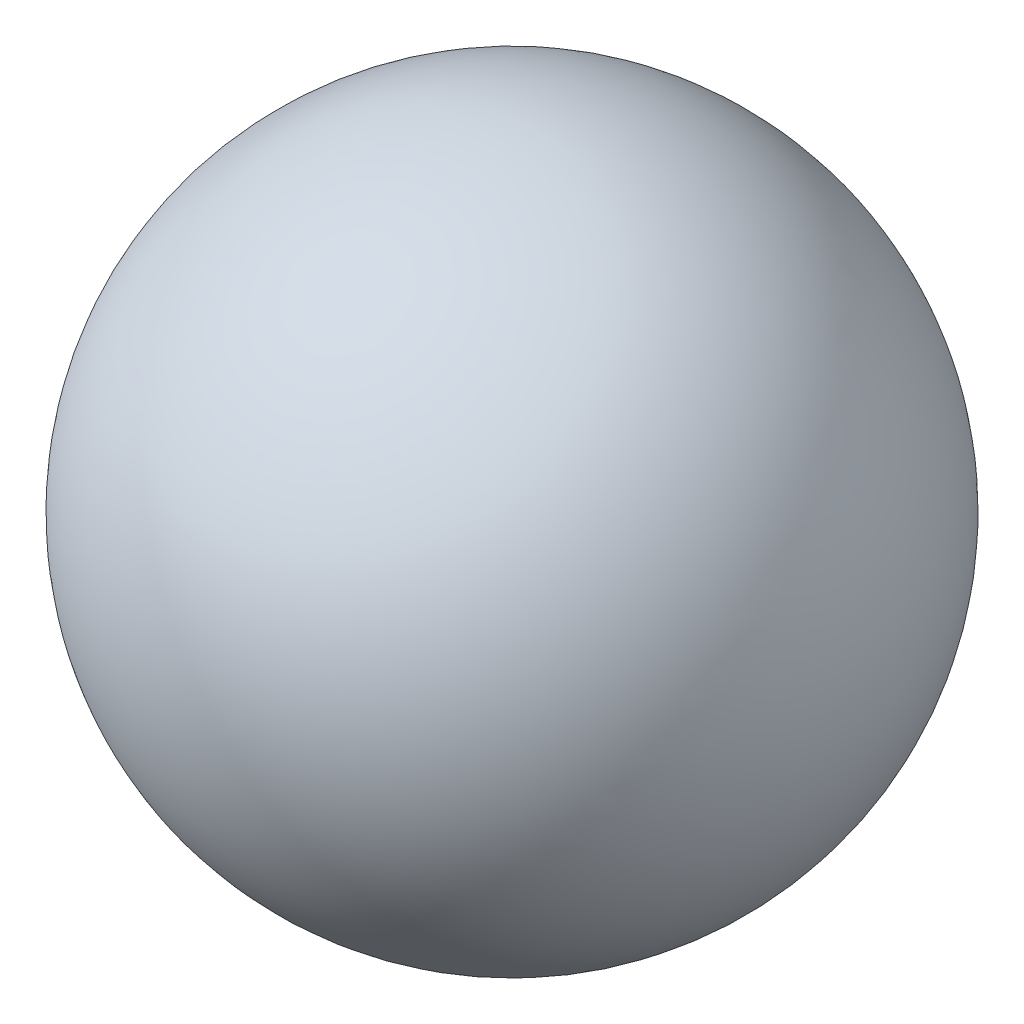
ISO-10303-21;
HEADER;
FILE_DESCRIPTION(('STEP AP214'),'2;1');
FILE_NAME('part.step','',(''),(''),'','','');
FILE_SCHEMA(('AUTOMOTIVE_DESIGN { 1 0 10303 214 1 1 1 1 }'));
ENDSEC;
DATA;
#1=APPLICATION_CONTEXT('core data for automotive mechanical design processes');
#2=APPLICATION_PROTOCOL_DEFINITION('international standard','automotive_design',2000,#1);
#3=PRODUCT_CONTEXT('',#1,'mechanical');
#4=PRODUCT('Part','Part','',(#3));
#5=PRODUCT_RELATED_PRODUCT_CATEGORY('part','',(#4));
#6=PRODUCT_DEFINITION_FORMATION('','',#4);
#7=PRODUCT_DEFINITION_CONTEXT('part definition',#1,'design');
#8=PRODUCT_DEFINITION('design','',#6,#7);
#9=PRODUCT_DEFINITION_SHAPE('','',#8);
#10=(LENGTH_UNIT() NAMED_UNIT(*) SI_UNIT(.MILLI.,.METRE.));
#11=(NAMED_UNIT(*) PLANE_ANGLE_UNIT() SI_UNIT($,.RADIAN.));
#12=(NAMED_UNIT(*) SI_UNIT($,.STERADIAN.) SOLID_ANGLE_UNIT());
#13=UNCERTAINTY_MEASURE_WITH_UNIT(LENGTH_MEASURE(1.E-05),#10,'distance_accuracy_value','');
#14=(GEOMETRIC_REPRESENTATION_CONTEXT(3) GLOBAL_UNCERTAINTY_ASSIGNED_CONTEXT((#13)) GLOBAL_UNIT_ASSIGNED_CONTEXT((#10,
#11,#12)) REPRESENTATION_CONTEXT('',''));
#15=CARTESIAN_POINT('',(0.,0.,0.));
#16=DIRECTION('',(0.,0.,1.));
#17=DIRECTION('',(1.,0.,0.));
#18=AXIS2_PLACEMENT_3D('',#15,#16,#17);
#19=CARTESIAN_POINT('',(-8.10842838491481,-2.,8.50387494773458));
#20=DIRECTION('',(0.,0.,1.));
#21=DIRECTION('',(1.,0.,0.));
#22=AXIS2_PLACEMENT_3D('',#19,#20,#21);
#23=SPHERICAL_SURFACE('',#22,1.05);
#24=CARTESIAN_POINT('',(-8.10842838491481,-2.,9.55387494773458));
#25=VERTEX_POINT('',#24);
#26=VERTEX_LOOP('',#25);
#27=FACE_BOUND('',#26,.T.);
#28=ADVANCED_FACE('F12',(#27),#23,.T.);
#29=CLOSED_SHELL('',(#28));
#30=MANIFOLD_SOLID_BREP('B1',#29);
#31=ADVANCED_BREP_SHAPE_REPRESENTATION('',(#18,#30),#14);
#32=SHAPE_DEFINITION_REPRESENTATION(#9,#31);
ENDSEC;
END-ISO-10303-21;
